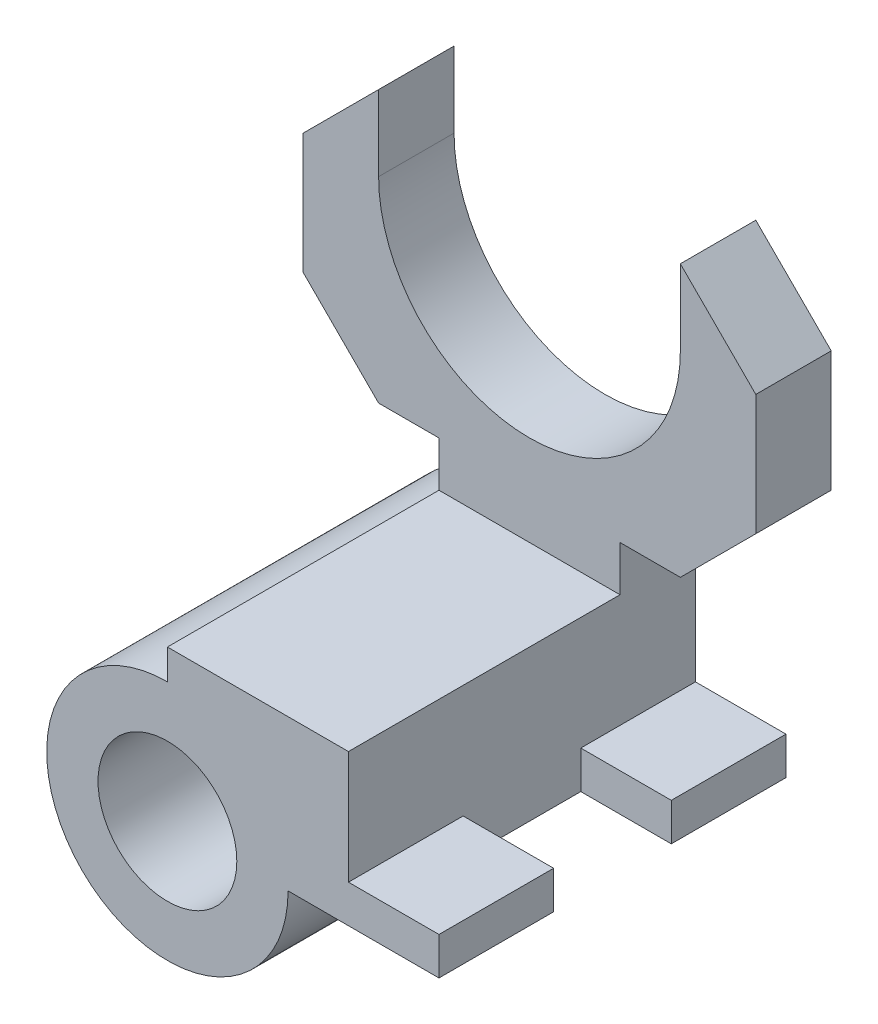
ISO-10303-21;
HEADER;
FILE_DESCRIPTION(('STEP AP214'),'2;1');
FILE_NAME('part.step','',(''),(''),'','','');
FILE_SCHEMA(('AUTOMOTIVE_DESIGN { 1 0 10303 214 1 1 1 1 }'));
ENDSEC;
DATA;
#1=APPLICATION_CONTEXT('core data for automotive mechanical design processes');
#2=APPLICATION_PROTOCOL_DEFINITION('international standard','automotive_design',2000,#1);
#3=PRODUCT_CONTEXT('',#1,'mechanical');
#4=PRODUCT('Part','Part','',(#3));
#5=PRODUCT_RELATED_PRODUCT_CATEGORY('part','',(#4));
#6=PRODUCT_DEFINITION_FORMATION('','',#4);
#7=PRODUCT_DEFINITION_CONTEXT('part definition',#1,'design');
#8=PRODUCT_DEFINITION('design','',#6,#7);
#9=PRODUCT_DEFINITION_SHAPE('','',#8);
#10=(LENGTH_UNIT() NAMED_UNIT(*) SI_UNIT(.MILLI.,.METRE.));
#11=(NAMED_UNIT(*) PLANE_ANGLE_UNIT() SI_UNIT($,.RADIAN.));
#12=(NAMED_UNIT(*) SI_UNIT($,.STERADIAN.) SOLID_ANGLE_UNIT());
#13=UNCERTAINTY_MEASURE_WITH_UNIT(LENGTH_MEASURE(1.E-05),#10,'distance_accuracy_value','');
#14=(GEOMETRIC_REPRESENTATION_CONTEXT(3) GLOBAL_UNCERTAINTY_ASSIGNED_CONTEXT((#13)) GLOBAL_UNIT_ASSIGNED_CONTEXT((#10,
#11,#12)) REPRESENTATION_CONTEXT('',''));
#15=CARTESIAN_POINT('',(0.,0.,0.));
#16=DIRECTION('',(0.,0.,1.));
#17=DIRECTION('',(1.,0.,0.));
#18=AXIS2_PLACEMENT_3D('',#15,#16,#17);
#19=CARTESIAN_POINT('',(0.,0.,12.7));
#20=DIRECTION('',(-1.,0.,0.));
#21=DIRECTION('',(0.,-1.,0.));
#22=AXIS2_PLACEMENT_3D('',#19,#20,#21);
#23=PLANE('',#22);
#24=DIRECTION('',(0.,0.,1.));
#25=VECTOR('',#24,1.);
#26=CARTESIAN_POINT('',(0.,6.35,39.116));
#27=LINE('',#26,#25);
#28=CARTESIAN_POINT('',(0.,6.35,39.116));
#29=VERTEX_POINT('',#28);
#30=CARTESIAN_POINT('',(0.,6.35,58.42));
#31=VERTEX_POINT('',#30);
#32=EDGE_CURVE('E70',#29,#31,#27,.T.);
#33=ORIENTED_EDGE('',*,*,#32,.F.);
#34=DIRECTION('',(0.,1.,0.));
#35=VECTOR('',#34,1.);
#36=CARTESIAN_POINT('',(0.,0.,39.116));
#37=LINE('',#36,#35);
#38=CARTESIAN_POINT('',(0.,0.,39.116));
#39=VERTEX_POINT('',#38);
#40=EDGE_CURVE('E74',#39,#29,#37,.T.);
#41=ORIENTED_EDGE('',*,*,#40,.F.);
#42=DIRECTION('',(0.,0.,-1.));
#43=VECTOR('',#42,1.);
#44=CARTESIAN_POINT('',(0.,0.,12.7));
#45=LINE('',#44,#43);
#46=CARTESIAN_POINT('',(0.,0.,19.304));
#47=VERTEX_POINT('',#46);
#48=EDGE_CURVE('E377',#39,#47,#45,.T.);
#49=ORIENTED_EDGE('',*,*,#48,.T.);
#50=DIRECTION('',(0.,1.,0.));
#51=VECTOR('',#50,1.);
#52=CARTESIAN_POINT('',(0.,0.,19.304));
#53=LINE('',#52,#51);
#54=CARTESIAN_POINT('',(0.,6.35,19.304));
#55=VERTEX_POINT('',#54);
#56=EDGE_CURVE('E246',#47,#55,#53,.T.);
#57=ORIENTED_EDGE('',*,*,#56,.T.);
#58=DIRECTION('',(0.,0.,-1.));
#59=VECTOR('',#58,1.);
#60=CARTESIAN_POINT('',(0.,6.35,19.304));
#61=LINE('',#60,#59);
#62=CARTESIAN_POINT('',(0.,6.35,0.));
#63=VERTEX_POINT('',#62);
#64=EDGE_CURVE('E257',#55,#63,#61,.T.);
#65=ORIENTED_EDGE('',*,*,#64,.T.);
#66=DIRECTION('',(0.,1.,0.));
#67=VECTOR('',#66,1.);
#68=CARTESIAN_POINT('',(0.,0.,0.));
#69=LINE('',#68,#67);
#70=CARTESIAN_POINT('',(0.,33.02,0.));
#71=VERTEX_POINT('',#70);
#72=EDGE_CURVE('E314',#63,#71,#69,.T.);
#73=ORIENTED_EDGE('',*,*,#72,.T.);
#74=DIRECTION('',(0.,0.,-1.));
#75=VECTOR('',#74,1.);
#76=CARTESIAN_POINT('',(0.,33.02,12.7));
#77=LINE('',#76,#75);
#78=CARTESIAN_POINT('',(0.,33.02,12.7));
#79=VERTEX_POINT('',#78);
#80=EDGE_CURVE('E374',#79,#71,#77,.T.);
#81=ORIENTED_EDGE('',*,*,#80,.F.);
#82=DIRECTION('',(0.,1.,0.));
#83=VECTOR('',#82,1.);
#84=CARTESIAN_POINT('',(0.,0.,12.7));
#85=LINE('',#84,#83);
#86=CARTESIAN_POINT('',(0.,25.4,12.7));
#87=VERTEX_POINT('',#86);
#88=EDGE_CURVE('E288',#87,#79,#85,.T.);
#89=ORIENTED_EDGE('',*,*,#88,.F.);
#90=DIRECTION('',(0.,0.,-1.));
#91=VECTOR('',#90,1.);
#92=CARTESIAN_POINT('',(0.,25.4,58.42));
#93=LINE('',#92,#91);
#94=CARTESIAN_POINT('',(0.,25.4,58.42));
#95=VERTEX_POINT('',#94);
#96=EDGE_CURVE('E279',#95,#87,#93,.T.);
#97=ORIENTED_EDGE('',*,*,#96,.F.);
#98=DIRECTION('',(0.,-1.,0.));
#99=VECTOR('',#98,1.);
#100=CARTESIAN_POINT('',(0.,0.,58.42));
#101=LINE('',#100,#99);
#102=EDGE_CURVE('E269',#95,#31,#101,.T.);
#103=ORIENTED_EDGE('',*,*,#102,.T.);
#104=EDGE_LOOP('',(#33,#41,#49,#57,#65,#73,#81,#89,#97,#103));
#105=FACE_BOUND('',#104,.T.);
#106=ADVANCED_FACE('F53',(#105),#23,.F.);
#107=CARTESIAN_POINT('',(0.,0.,12.7));
#108=DIRECTION('',(0.,0.,1.));
#109=DIRECTION('',(1.,0.,0.));
#110=AXIS2_PLACEMENT_3D('',#107,#108,#109);
#111=PLANE('',#110);
#112=DIRECTION('',(0.,1.,0.));
#113=VECTOR('',#112,1.);
#114=CARTESIAN_POINT('',(-30.48,0.,12.7));
#115=LINE('',#114,#113);
#116=CARTESIAN_POINT('',(-30.48,25.4,12.7));
#117=VERTEX_POINT('',#116);
#118=CARTESIAN_POINT('',(-30.48,33.02,12.7));
#119=VERTEX_POINT('',#118);
#120=EDGE_CURVE('E348',#117,#119,#115,.T.);
#121=ORIENTED_EDGE('',*,*,#120,.F.);
#122=DIRECTION('',(1.,0.,0.));
#123=VECTOR('',#122,1.);
#124=CARTESIAN_POINT('',(0.,25.4,12.7));
#125=LINE('',#124,#123);
#126=EDGE_CURVE('E265',#117,#87,#125,.T.);
#127=ORIENTED_EDGE('',*,*,#126,.T.);
#128=ORIENTED_EDGE('',*,*,#88,.T.);
#129=DIRECTION('',(1.,0.,0.));
#130=VECTOR('',#129,1.);
#131=CARTESIAN_POINT('',(0.,33.02,12.7));
#132=LINE('',#131,#130);
#133=CARTESIAN_POINT('',(10.1600000000001,33.02,12.7));
#134=VERTEX_POINT('',#133);
#135=EDGE_CURVE('E381',#79,#134,#132,.T.);
#136=ORIENTED_EDGE('',*,*,#135,.T.);
#137=DIRECTION('',(0.707106781186546,0.707106781186549,0.));
#138=VECTOR('',#137,1.);
#139=CARTESIAN_POINT('',(-11.4299999999999,11.4299999999999,12.7));
#140=LINE('',#139,#138);
#141=CARTESIAN_POINT('',(22.86,45.72,12.7));
#142=VERTEX_POINT('',#141);
#143=EDGE_CURVE('E385',#134,#142,#140,.T.);
#144=ORIENTED_EDGE('',*,*,#143,.T.);
#145=DIRECTION('',(0.,1.,0.));
#146=VECTOR('',#145,1.);
#147=CARTESIAN_POINT('',(22.86,0.,12.7));
#148=LINE('',#147,#146);
#149=CARTESIAN_POINT('',(22.86,66.04,12.7));
#150=VERTEX_POINT('',#149);
#151=EDGE_CURVE('E389',#142,#150,#148,.T.);
#152=ORIENTED_EDGE('',*,*,#151,.T.);
#153=DIRECTION('',(-0.707106781186547,0.707106781186548,0.));
#154=VECTOR('',#153,1.);
#155=CARTESIAN_POINT('',(44.45,44.45,12.7));
#156=LINE('',#155,#154);
#157=CARTESIAN_POINT('',(10.16,78.74,12.7));
#158=VERTEX_POINT('',#157);
#159=EDGE_CURVE('E394',#150,#158,#156,.T.);
#160=ORIENTED_EDGE('',*,*,#159,.T.);
#161=DIRECTION('',(0.,1.,0.));
#162=VECTOR('',#161,1.);
#163=CARTESIAN_POINT('',(10.16,0.,12.7));
#164=LINE('',#163,#162);
#165=CARTESIAN_POINT('',(10.16,66.04,12.7));
#166=VERTEX_POINT('',#165);
#167=EDGE_CURVE('E396',#166,#158,#164,.T.);
#168=ORIENTED_EDGE('',*,*,#167,.F.);
#169=CARTESIAN_POINT('',(-15.24,66.04,12.7));
#170=DIRECTION('',(0.,0.,1.));
#171=DIRECTION('',(1.,0.,0.));
#172=AXIS2_PLACEMENT_3D('',#169,#170,#171);
#173=CIRCLE('',#172,25.4);
#174=CARTESIAN_POINT('',(-40.64,66.04,12.7));
#175=VERTEX_POINT('',#174);
#176=EDGE_CURVE('E399',#175,#166,#173,.T.);
#177=ORIENTED_EDGE('',*,*,#176,.F.);
#178=DIRECTION('',(0.,1.,0.));
#179=VECTOR('',#178,1.);
#180=CARTESIAN_POINT('',(-40.64,0.,12.7));
#181=LINE('',#180,#179);
#182=CARTESIAN_POINT('',(-40.64,78.74,12.7));
#183=VERTEX_POINT('',#182);
#184=EDGE_CURVE('E402',#175,#183,#181,.T.);
#185=ORIENTED_EDGE('',*,*,#184,.T.);
#186=DIRECTION('',(0.707106781186548,0.707106781186548,0.));
#187=VECTOR('',#186,1.);
#188=CARTESIAN_POINT('',(-59.69,59.69,12.7));
#189=LINE('',#188,#187);
#190=CARTESIAN_POINT('',(-53.34,66.04,12.7));
#191=VERTEX_POINT('',#190);
#192=EDGE_CURVE('E404',#191,#183,#189,.T.);
#193=ORIENTED_EDGE('',*,*,#192,.F.);
#194=DIRECTION('',(0.,1.,0.));
#195=VECTOR('',#194,1.);
#196=CARTESIAN_POINT('',(-53.34,0.,12.7));
#197=LINE('',#196,#195);
#198=CARTESIAN_POINT('',(-53.34,45.72,12.7));
#199=VERTEX_POINT('',#198);
#200=EDGE_CURVE('E407',#199,#191,#197,.T.);
#201=ORIENTED_EDGE('',*,*,#200,.F.);
#202=DIRECTION('',(-0.707106781186546,0.707106781186549,0.));
#203=VECTOR('',#202,1.);
#204=CARTESIAN_POINT('',(-3.81000000000013,-3.81000000000011,12.7));
#205=LINE('',#204,#203);
#206=CARTESIAN_POINT('',(-40.6400000000001,33.02,12.7));
#207=VERTEX_POINT('',#206);
#208=EDGE_CURVE('E409',#207,#199,#205,.T.);
#209=ORIENTED_EDGE('',*,*,#208,.F.);
#210=DIRECTION('',(-1.,0.,0.));
#211=VECTOR('',#210,1.);
#212=CARTESIAN_POINT('',(0.,33.02,12.7));
#213=LINE('',#212,#211);
#214=EDGE_CURVE('E309',#119,#207,#213,.T.);
#215=ORIENTED_EDGE('',*,*,#214,.F.);
#216=EDGE_LOOP('',(#121,#127,#128,#136,#144,#152,#160,#168,#177,#185,#193,#201,#209,#215));
#217=FACE_BOUND('',#216,.T.);
#218=ADVANCED_FACE('F418',(#217),#111,.T.);
#219=CARTESIAN_POINT('',(-30.48,0.,12.7));
#220=DIRECTION('',(-1.,0.,0.));
#221=DIRECTION('',(0.,0.,1.));
#222=AXIS2_PLACEMENT_3D('',#219,#220,#221);
#223=PLANE('',#222);
#224=DIRECTION('',(0.,1.,0.));
#225=VECTOR('',#224,1.);
#226=CARTESIAN_POINT('',(-30.48,0.,0.));
#227=LINE('',#226,#225);
#228=CARTESIAN_POINT('',(-30.48,20.32,0.));
#229=VERTEX_POINT('',#228);
#230=CARTESIAN_POINT('',(-30.48,33.02,0.));
#231=VERTEX_POINT('',#230);
#232=EDGE_CURVE('E293',#229,#231,#227,.T.);
#233=ORIENTED_EDGE('',*,*,#232,.F.);
#234=DIRECTION('',(0.,0.,-1.));
#235=VECTOR('',#234,1.);
#236=CARTESIAN_POINT('',(-30.48,20.32,12.7));
#237=LINE('',#236,#235);
#238=CARTESIAN_POINT('',(-30.48,20.32,58.42));
#239=VERTEX_POINT('',#238);
#240=EDGE_CURVE('E12',#239,#229,#237,.T.);
#241=ORIENTED_EDGE('',*,*,#240,.F.);
#242=DIRECTION('',(0.,-1.,0.));
#243=VECTOR('',#242,1.);
#244=CARTESIAN_POINT('',(-30.48,0.,58.42));
#245=LINE('',#244,#243);
#246=CARTESIAN_POINT('',(-30.48,25.4,58.42));
#247=VERTEX_POINT('',#246);
#248=EDGE_CURVE('E276',#247,#239,#245,.T.);
#249=ORIENTED_EDGE('',*,*,#248,.F.);
#250=DIRECTION('',(0.,0.,-1.));
#251=VECTOR('',#250,1.);
#252=CARTESIAN_POINT('',(-30.48,25.4,58.42));
#253=LINE('',#252,#251);
#254=EDGE_CURVE('E291',#247,#117,#253,.T.);
#255=ORIENTED_EDGE('',*,*,#254,.T.);
#256=ORIENTED_EDGE('',*,*,#120,.T.);
#257=DIRECTION('',(0.,0.,-1.));
#258=VECTOR('',#257,1.);
#259=CARTESIAN_POINT('',(-30.48,33.02,12.7));
#260=LINE('',#259,#258);
#261=EDGE_CURVE('E349',#119,#231,#260,.T.);
#262=ORIENTED_EDGE('',*,*,#261,.T.);
#263=EDGE_LOOP('',(#233,#241,#249,#255,#256,#262));
#264=FACE_BOUND('',#263,.T.);
#265=ADVANCED_FACE('F55',(#264),#223,.T.);
#266=CARTESIAN_POINT('',(-30.48,0.,12.7));
#267=DIRECTION('',(0.,0.,-1.));
#268=DIRECTION('',(-1.,0.,0.));
#269=AXIS2_PLACEMENT_3D('',#266,#267,#268);
#270=CYLINDRICAL_SURFACE('',#269,20.32);
#271=CARTESIAN_POINT('',(-30.48,0.,0.));
#272=DIRECTION('',(0.,0.,1.));
#273=DIRECTION('',(1.,0.,0.));
#274=AXIS2_PLACEMENT_3D('',#271,#272,#273);
#275=CIRCLE('',#274,20.32);
#276=CARTESIAN_POINT('',(-10.16,0.,0.));
#277=VERTEX_POINT('',#276);
#278=EDGE_CURVE('E298',#229,#277,#275,.T.);
#279=ORIENTED_EDGE('',*,*,#278,.T.);
#280=DIRECTION('',(0.,0.,-1.));
#281=VECTOR('',#280,1.);
#282=CARTESIAN_POINT('',(-10.16,0.,12.7));
#283=LINE('',#282,#281);
#284=CARTESIAN_POINT('',(-10.16,0.,58.42));
#285=VERTEX_POINT('',#284);
#286=EDGE_CURVE('E62',#285,#277,#283,.T.);
#287=ORIENTED_EDGE('',*,*,#286,.F.);
#288=CARTESIAN_POINT('',(-30.48,0.,58.42));
#289=DIRECTION('',(0.,0.,1.));
#290=DIRECTION('',(1.,0.,0.));
#291=AXIS2_PLACEMENT_3D('',#288,#289,#290);
#292=CIRCLE('',#291,20.32);
#293=EDGE_CURVE('E273',#239,#285,#292,.T.);
#294=ORIENTED_EDGE('',*,*,#293,.F.);
#295=ORIENTED_EDGE('',*,*,#240,.T.);
#296=EDGE_LOOP('',(#279,#287,#294,#295));
#297=FACE_BOUND('',#296,.T.);
#298=ADVANCED_FACE('F463',(#297),#270,.T.);
#299=CARTESIAN_POINT('',(0.,0.,12.7));
#300=DIRECTION('',(0.,-1.,0.));
#301=DIRECTION('',(1.,0.,0.));
#302=AXIS2_PLACEMENT_3D('',#299,#300,#301);
#303=PLANE('',#302);
#304=DIRECTION('',(-1.,0.,0.));
#305=VECTOR('',#304,1.);
#306=CARTESIAN_POINT('',(0.,0.,0.));
#307=LINE('',#306,#305);
#308=CARTESIAN_POINT('',(15.24,0.,0.));
#309=VERTEX_POINT('',#308);
#310=EDGE_CURVE('E306',#309,#277,#307,.T.);
#311=ORIENTED_EDGE('',*,*,#310,.F.);
#312=DIRECTION('',(0.,0.,-1.));
#313=VECTOR('',#312,1.);
#314=CARTESIAN_POINT('',(15.24,0.,19.304));
#315=LINE('',#314,#313);
#316=CARTESIAN_POINT('',(15.24,0.,19.304));
#317=VERTEX_POINT('',#316);
#318=EDGE_CURVE('E250',#317,#309,#315,.T.);
#319=ORIENTED_EDGE('',*,*,#318,.F.);
#320=DIRECTION('',(1.,0.,0.));
#321=VECTOR('',#320,1.);
#322=CARTESIAN_POINT('',(0.,0.,19.304));
#323=LINE('',#322,#321);
#324=EDGE_CURVE('E248',#47,#317,#323,.T.);
#325=ORIENTED_EDGE('',*,*,#324,.F.);
#326=ORIENTED_EDGE('',*,*,#48,.F.);
#327=DIRECTION('',(1.,0.,0.));
#328=VECTOR('',#327,1.);
#329=CARTESIAN_POINT('',(0.,0.,39.116));
#330=LINE('',#329,#328);
#331=CARTESIAN_POINT('',(15.24,0.,39.116));
#332=VERTEX_POINT('',#331);
#333=EDGE_CURVE('E223',#39,#332,#330,.T.);
#334=ORIENTED_EDGE('',*,*,#333,.T.);
#335=DIRECTION('',(0.,0.,1.));
#336=VECTOR('',#335,1.);
#337=CARTESIAN_POINT('',(15.24,0.,39.116));
#338=LINE('',#337,#336);
#339=CARTESIAN_POINT('',(15.24,0.,58.42));
#340=VERTEX_POINT('',#339);
#341=EDGE_CURVE('E227',#332,#340,#338,.T.);
#342=ORIENTED_EDGE('',*,*,#341,.T.);
#343=DIRECTION('',(1.,0.,0.));
#344=VECTOR('',#343,1.);
#345=CARTESIAN_POINT('',(0.,0.,58.42));
#346=LINE('',#345,#344);
#347=EDGE_CURVE('E271',#285,#340,#346,.T.);
#348=ORIENTED_EDGE('',*,*,#347,.F.);
#349=ORIENTED_EDGE('',*,*,#286,.T.);
#350=EDGE_LOOP('',(#311,#319,#325,#326,#334,#342,#348,#349));
#351=FACE_BOUND('',#350,.T.);
#352=ADVANCED_FACE('F461',(#351),#303,.T.);
#353=CARTESIAN_POINT('',(0.,33.02,12.7));
#354=DIRECTION('',(0.,1.,0.));
#355=DIRECTION('',(0.,0.,1.));
#356=AXIS2_PLACEMENT_3D('',#353,#354,#355);
#357=PLANE('',#356);
#358=DIRECTION('',(1.,0.,0.));
#359=VECTOR('',#358,1.);
#360=CARTESIAN_POINT('',(0.,33.02,0.));
#361=LINE('',#360,#359);
#362=CARTESIAN_POINT('',(10.1600000000001,33.02,0.));
#363=VERTEX_POINT('',#362);
#364=EDGE_CURVE('E316',#71,#363,#361,.T.);
#365=ORIENTED_EDGE('',*,*,#364,.T.);
#366=DIRECTION('',(0.,0.,-1.));
#367=VECTOR('',#366,1.);
#368=CARTESIAN_POINT('',(10.1600000000001,33.02,12.7));
#369=LINE('',#368,#367);
#370=EDGE_CURVE('E371',#134,#363,#369,.T.);
#371=ORIENTED_EDGE('',*,*,#370,.F.);
#372=ORIENTED_EDGE('',*,*,#135,.F.);
#373=ORIENTED_EDGE('',*,*,#80,.T.);
#374=EDGE_LOOP('',(#365,#371,#372,#373));
#375=FACE_BOUND('',#374,.T.);
#376=ADVANCED_FACE('F459',(#375),#357,.F.);
#377=CARTESIAN_POINT('',(-11.4299999999999,11.4299999999999,12.7));
#378=DIRECTION('',(-0.707106781186549,0.707106781186546,0.));
#379=DIRECTION('',(-0.707106781186546,-0.707106781186549,0.));
#380=AXIS2_PLACEMENT_3D('',#377,#378,#379);
#381=PLANE('',#380);
#382=DIRECTION('',(0.707106781186546,0.707106781186549,0.));
#383=VECTOR('',#382,1.);
#384=CARTESIAN_POINT('',(-11.4299999999999,11.4299999999999,0.));
#385=LINE('',#384,#383);
#386=CARTESIAN_POINT('',(22.86,45.72,0.));
#387=VERTEX_POINT('',#386);
#388=EDGE_CURVE('E318',#363,#387,#385,.T.);
#389=ORIENTED_EDGE('',*,*,#388,.T.);
#390=DIRECTION('',(0.,0.,-1.));
#391=VECTOR('',#390,1.);
#392=CARTESIAN_POINT('',(22.86,45.72,12.7));
#393=LINE('',#392,#391);
#394=EDGE_CURVE('E368',#142,#387,#393,.T.);
#395=ORIENTED_EDGE('',*,*,#394,.F.);
#396=ORIENTED_EDGE('',*,*,#143,.F.);
#397=ORIENTED_EDGE('',*,*,#370,.T.);
#398=EDGE_LOOP('',(#389,#395,#396,#397));
#399=FACE_BOUND('',#398,.T.);
#400=ADVANCED_FACE('F492',(#399),#381,.F.);
#401=CARTESIAN_POINT('',(22.86,0.,12.7));
#402=DIRECTION('',(-1.,0.,0.));
#403=DIRECTION('',(0.,-1.,0.));
#404=AXIS2_PLACEMENT_3D('',#401,#402,#403);
#405=PLANE('',#404);
#406=DIRECTION('',(0.,1.,0.));
#407=VECTOR('',#406,1.);
#408=CARTESIAN_POINT('',(22.86,0.,0.));
#409=LINE('',#408,#407);
#410=CARTESIAN_POINT('',(22.86,66.04,0.));
#411=VERTEX_POINT('',#410);
#412=EDGE_CURVE('E320',#387,#411,#409,.T.);
#413=ORIENTED_EDGE('',*,*,#412,.T.);
#414=DIRECTION('',(0.,0.,-1.));
#415=VECTOR('',#414,1.);
#416=CARTESIAN_POINT('',(22.86,66.04,12.7));
#417=LINE('',#416,#415);
#418=EDGE_CURVE('E365',#150,#411,#417,.T.);
#419=ORIENTED_EDGE('',*,*,#418,.F.);
#420=ORIENTED_EDGE('',*,*,#151,.F.);
#421=ORIENTED_EDGE('',*,*,#394,.T.);
#422=EDGE_LOOP('',(#413,#419,#420,#421));
#423=FACE_BOUND('',#422,.T.);
#424=ADVANCED_FACE('F499',(#423),#405,.F.);
#425=CARTESIAN_POINT('',(44.45,44.45,12.7));
#426=DIRECTION('',(-0.707106781186548,-0.707106781186547,0.));
#427=DIRECTION('',(0.707106781186547,-0.707106781186548,0.));
#428=AXIS2_PLACEMENT_3D('',#425,#426,#427);
#429=PLANE('',#428);
#430=DIRECTION('',(-0.707106781186547,0.707106781186548,0.));
#431=VECTOR('',#430,1.);
#432=CARTESIAN_POINT('',(44.45,44.45,0.));
#433=LINE('',#432,#431);
#434=CARTESIAN_POINT('',(10.16,78.74,0.));
#435=VERTEX_POINT('',#434);
#436=EDGE_CURVE('E322',#411,#435,#433,.T.);
#437=ORIENTED_EDGE('',*,*,#436,.T.);
#438=DIRECTION('',(0.,0.,-1.));
#439=VECTOR('',#438,1.);
#440=CARTESIAN_POINT('',(10.16,78.74,12.7));
#441=LINE('',#440,#439);
#442=EDGE_CURVE('E363',#158,#435,#441,.T.);
#443=ORIENTED_EDGE('',*,*,#442,.F.);
#444=ORIENTED_EDGE('',*,*,#159,.F.);
#445=ORIENTED_EDGE('',*,*,#418,.T.);
#446=EDGE_LOOP('',(#437,#443,#444,#445));
#447=FACE_BOUND('',#446,.T.);
#448=ADVANCED_FACE('F503',(#447),#429,.F.);
#449=CARTESIAN_POINT('',(10.16,0.,12.7));
#450=DIRECTION('',(-1.,0.,0.));
#451=DIRECTION('',(0.,0.,1.));
#452=AXIS2_PLACEMENT_3D('',#449,#450,#451);
#453=PLANE('',#452);
#454=DIRECTION('',(0.,1.,0.));
#455=VECTOR('',#454,1.);
#456=CARTESIAN_POINT('',(10.16,0.,0.));
#457=LINE('',#456,#455);
#458=CARTESIAN_POINT('',(10.16,66.04,0.));
#459=VERTEX_POINT('',#458);
#460=EDGE_CURVE('E325',#459,#435,#457,.T.);
#461=ORIENTED_EDGE('',*,*,#460,.F.);
#462=DIRECTION('',(0.,0.,-1.));
#463=VECTOR('',#462,1.);
#464=CARTESIAN_POINT('',(10.16,66.04,12.7));
#465=LINE('',#464,#463);
#466=EDGE_CURVE('E361',#166,#459,#465,.T.);
#467=ORIENTED_EDGE('',*,*,#466,.F.);
#468=ORIENTED_EDGE('',*,*,#167,.T.);
#469=ORIENTED_EDGE('',*,*,#442,.T.);
#470=EDGE_LOOP('',(#461,#467,#468,#469));
#471=FACE_BOUND('',#470,.T.);
#472=ADVANCED_FACE('F506',(#471),#453,.T.);
#473=CARTESIAN_POINT('',(-15.24,66.04,12.7));
#474=DIRECTION('',(0.,0.,-1.));
#475=DIRECTION('',(-1.,0.,0.));
#476=AXIS2_PLACEMENT_3D('',#473,#474,#475);
#477=CYLINDRICAL_SURFACE('',#476,25.4);
#478=CARTESIAN_POINT('',(-15.24,66.04,0.));
#479=DIRECTION('',(0.,0.,1.));
#480=DIRECTION('',(1.,0.,0.));
#481=AXIS2_PLACEMENT_3D('',#478,#479,#480);
#482=CIRCLE('',#481,25.4);
#483=CARTESIAN_POINT('',(-40.64,66.04,0.));
#484=VERTEX_POINT('',#483);
#485=EDGE_CURVE('E328',#484,#459,#482,.T.);
#486=ORIENTED_EDGE('',*,*,#485,.F.);
#487=DIRECTION('',(0.,0.,-1.));
#488=VECTOR('',#487,1.);
#489=CARTESIAN_POINT('',(-40.64,66.04,12.7));
#490=LINE('',#489,#488);
#491=EDGE_CURVE('E359',#175,#484,#490,.T.);
#492=ORIENTED_EDGE('',*,*,#491,.F.);
#493=ORIENTED_EDGE('',*,*,#176,.T.);
#494=ORIENTED_EDGE('',*,*,#466,.T.);
#495=EDGE_LOOP('',(#486,#492,#493,#494));
#496=FACE_BOUND('',#495,.T.);
#497=ADVANCED_FACE('F510',(#496),#477,.F.);
#498=CARTESIAN_POINT('',(-40.64,0.,12.7));
#499=DIRECTION('',(-1.,0.,0.));
#500=DIRECTION('',(0.,0.,1.));
#501=AXIS2_PLACEMENT_3D('',#498,#499,#500);
#502=PLANE('',#501);
#503=DIRECTION('',(0.,1.,0.));
#504=VECTOR('',#503,1.);
#505=CARTESIAN_POINT('',(-40.64,0.,0.));
#506=LINE('',#505,#504);
#507=CARTESIAN_POINT('',(-40.64,78.74,0.));
#508=VERTEX_POINT('',#507);
#509=EDGE_CURVE('E331',#484,#508,#506,.T.);
#510=ORIENTED_EDGE('',*,*,#509,.T.);
#511=DIRECTION('',(0.,0.,-1.));
#512=VECTOR('',#511,1.);
#513=CARTESIAN_POINT('',(-40.64,78.74,12.7));
#514=LINE('',#513,#512);
#515=EDGE_CURVE('E357',#183,#508,#514,.T.);
#516=ORIENTED_EDGE('',*,*,#515,.F.);
#517=ORIENTED_EDGE('',*,*,#184,.F.);
#518=ORIENTED_EDGE('',*,*,#491,.T.);
#519=EDGE_LOOP('',(#510,#516,#517,#518));
#520=FACE_BOUND('',#519,.T.);
#521=ADVANCED_FACE('F515',(#520),#502,.F.);
#522=CARTESIAN_POINT('',(-59.69,59.69,12.7));
#523=DIRECTION('',(-0.707106781186548,0.707106781186548,0.));
#524=DIRECTION('',(-0.707106781186548,-0.707106781186548,0.));
#525=AXIS2_PLACEMENT_3D('',#522,#523,#524);
#526=PLANE('',#525);
#527=DIRECTION('',(0.707106781186548,0.707106781186548,0.));
#528=VECTOR('',#527,1.);
#529=CARTESIAN_POINT('',(-59.69,59.69,0.));
#530=LINE('',#529,#528);
#531=CARTESIAN_POINT('',(-53.34,66.04,0.));
#532=VERTEX_POINT('',#531);
#533=EDGE_CURVE('E334',#532,#508,#530,.T.);
#534=ORIENTED_EDGE('',*,*,#533,.F.);
#535=DIRECTION('',(0.,0.,-1.));
#536=VECTOR('',#535,1.);
#537=CARTESIAN_POINT('',(-53.34,66.04,12.7));
#538=LINE('',#537,#536);
#539=EDGE_CURVE('E355',#191,#532,#538,.T.);
#540=ORIENTED_EDGE('',*,*,#539,.F.);
#541=ORIENTED_EDGE('',*,*,#192,.T.);
#542=ORIENTED_EDGE('',*,*,#515,.T.);
#543=EDGE_LOOP('',(#534,#540,#541,#542));
#544=FACE_BOUND('',#543,.T.);
#545=ADVANCED_FACE('F517',(#544),#526,.T.);
#546=CARTESIAN_POINT('',(-53.34,0.,12.7));
#547=DIRECTION('',(-1.,0.,0.));
#548=DIRECTION('',(0.,-1.,0.));
#549=AXIS2_PLACEMENT_3D('',#546,#547,#548);
#550=PLANE('',#549);
#551=DIRECTION('',(0.,1.,0.));
#552=VECTOR('',#551,1.);
#553=CARTESIAN_POINT('',(-53.34,0.,0.));
#554=LINE('',#553,#552);
#555=CARTESIAN_POINT('',(-53.34,45.72,0.));
#556=VERTEX_POINT('',#555);
#557=EDGE_CURVE('E337',#556,#532,#554,.T.);
#558=ORIENTED_EDGE('',*,*,#557,.F.);
#559=DIRECTION('',(0.,0.,-1.));
#560=VECTOR('',#559,1.);
#561=CARTESIAN_POINT('',(-53.34,45.72,12.7));
#562=LINE('',#561,#560);
#563=EDGE_CURVE('E353',#199,#556,#562,.T.);
#564=ORIENTED_EDGE('',*,*,#563,.F.);
#565=ORIENTED_EDGE('',*,*,#200,.T.);
#566=ORIENTED_EDGE('',*,*,#539,.T.);
#567=EDGE_LOOP('',(#558,#564,#565,#566));
#568=FACE_BOUND('',#567,.T.);
#569=ADVANCED_FACE('F423',(#568),#550,.T.);
#570=CARTESIAN_POINT('',(-3.81000000000013,-3.81000000000011,12.7));
#571=DIRECTION('',(-0.707106781186549,-0.707106781186546,0.));
#572=DIRECTION('',(0.707106781186546,-0.707106781186549,0.));
#573=AXIS2_PLACEMENT_3D('',#570,#571,#572);
#574=PLANE('',#573);
#575=DIRECTION('',(-0.707106781186546,0.707106781186549,0.));
#576=VECTOR('',#575,1.);
#577=CARTESIAN_POINT('',(-3.81000000000013,-3.81000000000011,0.));
#578=LINE('',#577,#576);
#579=CARTESIAN_POINT('',(-40.6400000000001,33.02,0.));
#580=VERTEX_POINT('',#579);
#581=EDGE_CURVE('E340',#580,#556,#578,.T.);
#582=ORIENTED_EDGE('',*,*,#581,.F.);
#583=DIRECTION('',(0.,0.,-1.));
#584=VECTOR('',#583,1.);
#585=CARTESIAN_POINT('',(-40.6400000000001,33.02,12.7));
#586=LINE('',#585,#584);
#587=EDGE_CURVE('E351',#207,#580,#586,.T.);
#588=ORIENTED_EDGE('',*,*,#587,.F.);
#589=ORIENTED_EDGE('',*,*,#208,.T.);
#590=ORIENTED_EDGE('',*,*,#563,.T.);
#591=EDGE_LOOP('',(#582,#588,#589,#590));
#592=FACE_BOUND('',#591,.T.);
#593=ADVANCED_FACE('F425',(#592),#574,.T.);
#594=CARTESIAN_POINT('',(0.,33.02,12.7));
#595=DIRECTION('',(0.,-1.,0.));
#596=DIRECTION('',(0.,0.,-1.));
#597=AXIS2_PLACEMENT_3D('',#594,#595,#596);
#598=PLANE('',#597);
#599=DIRECTION('',(-1.,0.,0.));
#600=VECTOR('',#599,1.);
#601=CARTESIAN_POINT('',(0.,33.02,0.));
#602=LINE('',#601,#600);
#603=EDGE_CURVE('E343',#231,#580,#602,.T.);
#604=ORIENTED_EDGE('',*,*,#603,.F.);
#605=ORIENTED_EDGE('',*,*,#261,.F.);
#606=ORIENTED_EDGE('',*,*,#214,.T.);
#607=ORIENTED_EDGE('',*,*,#587,.T.);
#608=EDGE_LOOP('',(#604,#605,#606,#607));
#609=FACE_BOUND('',#608,.T.);
#610=ADVANCED_FACE('F416',(#609),#598,.T.);
#611=CARTESIAN_POINT('',(-30.48,0.,12.7));
#612=DIRECTION('',(0.,0.,-1.));
#613=DIRECTION('',(-1.,0.,0.));
#614=AXIS2_PLACEMENT_3D('',#611,#612,#613);
#615=CYLINDRICAL_SURFACE('',#614,11.684);
#616=CARTESIAN_POINT('',(-30.48,0.,0.));
#617=DIRECTION('',(0.,0.,1.));
#618=DIRECTION('',(1.,0.,0.));
#619=AXIS2_PLACEMENT_3D('',#616,#617,#618);
#620=CIRCLE('',#619,11.684);
#621=CARTESIAN_POINT('',(-18.796,0.,0.));
#622=VERTEX_POINT('',#621);
#623=EDGE_CURVE('E345',#622,#622,#620,.T.);
#624=ORIENTED_EDGE('',*,*,#623,.F.);
#625=EDGE_LOOP('',(#624));
#626=FACE_BOUND('',#625,.T.);
#627=CARTESIAN_POINT('',(-30.48,0.,58.42));
#628=DIRECTION('',(0.,0.,1.));
#629=DIRECTION('',(1.,0.,0.));
#630=AXIS2_PLACEMENT_3D('',#627,#628,#629);
#631=CIRCLE('',#630,11.684);
#632=CARTESIAN_POINT('',(-18.796,0.,58.42));
#633=VERTEX_POINT('',#632);
#634=EDGE_CURVE('E262',#633,#633,#631,.T.);
#635=ORIENTED_EDGE('',*,*,#634,.T.);
#636=EDGE_LOOP('',(#635));
#637=FACE_BOUND('',#636,.T.);
#638=ADVANCED_FACE('F430',(#626,#637),#615,.F.);
#639=CARTESIAN_POINT('',(0.,0.,0.));
#640=DIRECTION('',(0.,0.,1.));
#641=DIRECTION('',(1.,0.,0.));
#642=AXIS2_PLACEMENT_3D('',#639,#640,#641);
#643=PLANE('',#642);
#644=ORIENTED_EDGE('',*,*,#232,.T.);
#645=ORIENTED_EDGE('',*,*,#603,.T.);
#646=ORIENTED_EDGE('',*,*,#581,.T.);
#647=ORIENTED_EDGE('',*,*,#557,.T.);
#648=ORIENTED_EDGE('',*,*,#533,.T.);
#649=ORIENTED_EDGE('',*,*,#509,.F.);
#650=ORIENTED_EDGE('',*,*,#485,.T.);
#651=ORIENTED_EDGE('',*,*,#460,.T.);
#652=ORIENTED_EDGE('',*,*,#436,.F.);
#653=ORIENTED_EDGE('',*,*,#412,.F.);
#654=ORIENTED_EDGE('',*,*,#388,.F.);
#655=ORIENTED_EDGE('',*,*,#364,.F.);
#656=ORIENTED_EDGE('',*,*,#72,.F.);
#657=DIRECTION('',(1.,0.,0.));
#658=VECTOR('',#657,1.);
#659=CARTESIAN_POINT('',(0.,6.35,0.));
#660=LINE('',#659,#658);
#661=CARTESIAN_POINT('',(15.24,6.35,0.));
#662=VERTEX_POINT('',#661);
#663=EDGE_CURVE('E243',#63,#662,#660,.T.);
#664=ORIENTED_EDGE('',*,*,#663,.T.);
#665=DIRECTION('',(0.,-1.,0.));
#666=VECTOR('',#665,1.);
#667=CARTESIAN_POINT('',(15.24,0.,0.));
#668=LINE('',#667,#666);
#669=EDGE_CURVE('E237',#662,#309,#668,.T.);
#670=ORIENTED_EDGE('',*,*,#669,.T.);
#671=ORIENTED_EDGE('',*,*,#310,.T.);
#672=ORIENTED_EDGE('',*,*,#278,.F.);
#673=EDGE_LOOP('',(#644,#645,#646,#647,#648,#649,#650,#651,#652,#653,#654,#655,#656,#664,#670,
#671,#672));
#674=FACE_BOUND('',#673,.T.);
#675=ORIENTED_EDGE('',*,*,#623,.T.);
#676=EDGE_LOOP('',(#675));
#677=FACE_BOUND('',#676,.T.);
#678=ADVANCED_FACE('F426',(#674,#677),#643,.F.);
#679=CARTESIAN_POINT('',(-30.48,0.,58.42));
#680=DIRECTION('',(0.,0.,1.));
#681=DIRECTION('',(1.,0.,0.));
#682=AXIS2_PLACEMENT_3D('',#679,#680,#681);
#683=PLANE('',#682);
#684=DIRECTION('',(1.,0.,0.));
#685=VECTOR('',#684,1.);
#686=CARTESIAN_POINT('',(0.,25.4,58.42));
#687=LINE('',#686,#685);
#688=EDGE_CURVE('E266',#247,#95,#687,.T.);
#689=ORIENTED_EDGE('',*,*,#688,.F.);
#690=ORIENTED_EDGE('',*,*,#248,.T.);
#691=ORIENTED_EDGE('',*,*,#293,.T.);
#692=ORIENTED_EDGE('',*,*,#347,.T.);
#693=DIRECTION('',(0.,-1.,0.));
#694=VECTOR('',#693,1.);
#695=CARTESIAN_POINT('',(15.24,0.,58.42));
#696=LINE('',#695,#694);
#697=CARTESIAN_POINT('',(15.24,6.35,58.42));
#698=VERTEX_POINT('',#697);
#699=EDGE_CURVE('E230',#698,#340,#696,.T.);
#700=ORIENTED_EDGE('',*,*,#699,.F.);
#701=DIRECTION('',(1.,0.,0.));
#702=VECTOR('',#701,1.);
#703=CARTESIAN_POINT('',(0.,6.35,58.42));
#704=LINE('',#703,#702);
#705=EDGE_CURVE('E219',#31,#698,#704,.T.);
#706=ORIENTED_EDGE('',*,*,#705,.F.);
#707=ORIENTED_EDGE('',*,*,#102,.F.);
#708=EDGE_LOOP('',(#689,#690,#691,#692,#700,#706,#707));
#709=FACE_BOUND('',#708,.T.);
#710=ORIENTED_EDGE('',*,*,#634,.F.);
#711=EDGE_LOOP('',(#710));
#712=FACE_BOUND('',#711,.T.);
#713=ADVANCED_FACE('F429',(#709,#712),#683,.T.);
#714=CARTESIAN_POINT('',(0.,25.4,58.42));
#715=DIRECTION('',(0.,1.,0.));
#716=DIRECTION('',(-1.,0.,0.));
#717=AXIS2_PLACEMENT_3D('',#714,#715,#716);
#718=PLANE('',#717);
#719=ORIENTED_EDGE('',*,*,#126,.F.);
#720=ORIENTED_EDGE('',*,*,#254,.F.);
#721=ORIENTED_EDGE('',*,*,#688,.T.);
#722=ORIENTED_EDGE('',*,*,#96,.T.);
#723=EDGE_LOOP('',(#719,#720,#721,#722));
#724=FACE_BOUND('',#723,.T.);
#725=ADVANCED_FACE('F440',(#724),#718,.T.);
#726=CARTESIAN_POINT('',(15.24,0.,19.304));
#727=DIRECTION('',(1.,0.,0.));
#728=DIRECTION('',(0.,1.,0.));
#729=AXIS2_PLACEMENT_3D('',#726,#727,#728);
#730=PLANE('',#729);
#731=ORIENTED_EDGE('',*,*,#669,.F.);
#732=DIRECTION('',(0.,0.,-1.));
#733=VECTOR('',#732,1.);
#734=CARTESIAN_POINT('',(15.24,6.35,19.304));
#735=LINE('',#734,#733);
#736=CARTESIAN_POINT('',(15.24,6.35,19.304));
#737=VERTEX_POINT('',#736);
#738=EDGE_CURVE('E260',#737,#662,#735,.T.);
#739=ORIENTED_EDGE('',*,*,#738,.F.);
#740=DIRECTION('',(0.,-1.,0.));
#741=VECTOR('',#740,1.);
#742=CARTESIAN_POINT('',(15.24,0.,19.304));
#743=LINE('',#742,#741);
#744=EDGE_CURVE('E239',#737,#317,#743,.T.);
#745=ORIENTED_EDGE('',*,*,#744,.T.);
#746=ORIENTED_EDGE('',*,*,#318,.T.);
#747=EDGE_LOOP('',(#731,#739,#745,#746));
#748=FACE_BOUND('',#747,.T.);
#749=ADVANCED_FACE('F446',(#748),#730,.T.);
#750=CARTESIAN_POINT('',(0.,6.35,19.304));
#751=DIRECTION('',(0.,1.,0.));
#752=DIRECTION('',(0.,0.,1.));
#753=AXIS2_PLACEMENT_3D('',#750,#751,#752);
#754=PLANE('',#753);
#755=ORIENTED_EDGE('',*,*,#663,.F.);
#756=ORIENTED_EDGE('',*,*,#64,.F.);
#757=DIRECTION('',(1.,0.,0.));
#758=VECTOR('',#757,1.);
#759=CARTESIAN_POINT('',(0.,6.35,19.304));
#760=LINE('',#759,#758);
#761=EDGE_CURVE('E242',#55,#737,#760,.T.);
#762=ORIENTED_EDGE('',*,*,#761,.T.);
#763=ORIENTED_EDGE('',*,*,#738,.T.);
#764=EDGE_LOOP('',(#755,#756,#762,#763));
#765=FACE_BOUND('',#764,.T.);
#766=ADVANCED_FACE('F484',(#765),#754,.T.);
#767=CARTESIAN_POINT('',(0.,0.,19.304));
#768=DIRECTION('',(0.,0.,1.));
#769=DIRECTION('',(1.,0.,0.));
#770=AXIS2_PLACEMENT_3D('',#767,#768,#769);
#771=PLANE('',#770);
#772=ORIENTED_EDGE('',*,*,#744,.F.);
#773=ORIENTED_EDGE('',*,*,#761,.F.);
#774=ORIENTED_EDGE('',*,*,#56,.F.);
#775=ORIENTED_EDGE('',*,*,#324,.T.);
#776=EDGE_LOOP('',(#772,#773,#774,#775));
#777=FACE_BOUND('',#776,.T.);
#778=ADVANCED_FACE('F479',(#777),#771,.T.);
#779=CARTESIAN_POINT('',(15.24,0.,39.116));
#780=DIRECTION('',(-1.,0.,0.));
#781=DIRECTION('',(0.,-1.,0.));
#782=AXIS2_PLACEMENT_3D('',#779,#780,#781);
#783=PLANE('',#782);
#784=ORIENTED_EDGE('',*,*,#699,.T.);
#785=ORIENTED_EDGE('',*,*,#341,.F.);
#786=DIRECTION('',(0.,-1.,0.));
#787=VECTOR('',#786,1.);
#788=CARTESIAN_POINT('',(15.24,0.,39.116));
#789=LINE('',#788,#787);
#790=CARTESIAN_POINT('',(15.24,6.35,39.116));
#791=VERTEX_POINT('',#790);
#792=EDGE_CURVE('E211',#791,#332,#789,.T.);
#793=ORIENTED_EDGE('',*,*,#792,.F.);
#794=DIRECTION('',(0.,0.,1.));
#795=VECTOR('',#794,1.);
#796=CARTESIAN_POINT('',(15.24,6.35,39.116));
#797=LINE('',#796,#795);
#798=EDGE_CURVE('E216',#791,#698,#797,.T.);
#799=ORIENTED_EDGE('',*,*,#798,.T.);
#800=EDGE_LOOP('',(#784,#785,#793,#799));
#801=FACE_BOUND('',#800,.T.);
#802=ADVANCED_FACE('F225',(#801),#783,.F.);
#803=CARTESIAN_POINT('',(0.,6.35,39.116));
#804=DIRECTION('',(0.,-1.,0.));
#805=DIRECTION('',(0.,0.,-1.));
#806=AXIS2_PLACEMENT_3D('',#803,#804,#805);
#807=PLANE('',#806);
#808=ORIENTED_EDGE('',*,*,#705,.T.);
#809=ORIENTED_EDGE('',*,*,#798,.F.);
#810=DIRECTION('',(1.,0.,0.));
#811=VECTOR('',#810,1.);
#812=CARTESIAN_POINT('',(0.,6.35,39.116));
#813=LINE('',#812,#811);
#814=EDGE_CURVE('E206',#29,#791,#813,.T.);
#815=ORIENTED_EDGE('',*,*,#814,.F.);
#816=ORIENTED_EDGE('',*,*,#32,.T.);
#817=EDGE_LOOP('',(#808,#809,#815,#816));
#818=FACE_BOUND('',#817,.T.);
#819=ADVANCED_FACE('F217',(#818),#807,.F.);
#820=CARTESIAN_POINT('',(0.,0.,39.116));
#821=DIRECTION('',(0.,0.,1.));
#822=DIRECTION('',(1.,0.,0.));
#823=AXIS2_PLACEMENT_3D('',#820,#821,#822);
#824=PLANE('',#823);
#825=ORIENTED_EDGE('',*,*,#792,.T.);
#826=ORIENTED_EDGE('',*,*,#333,.F.);
#827=ORIENTED_EDGE('',*,*,#40,.T.);
#828=ORIENTED_EDGE('',*,*,#814,.T.);
#829=EDGE_LOOP('',(#825,#826,#827,#828));
#830=FACE_BOUND('',#829,.T.);
#831=ADVANCED_FACE('F208',(#830),#824,.F.);
#832=CLOSED_SHELL('',(#106,#218,#265,#298,#352,#376,#400,#424,#448,#472,#497,#521,#545,#569,
#593,#610,#638,#678,#713,#725,#749,#766,#778,#802,#819,#831));
#833=MANIFOLD_SOLID_BREP('B2',#832);
#834=ADVANCED_BREP_SHAPE_REPRESENTATION('',(#18,#833),#14);
#835=SHAPE_DEFINITION_REPRESENTATION(#9,#834);
ENDSEC;
END-ISO-10303-21;
